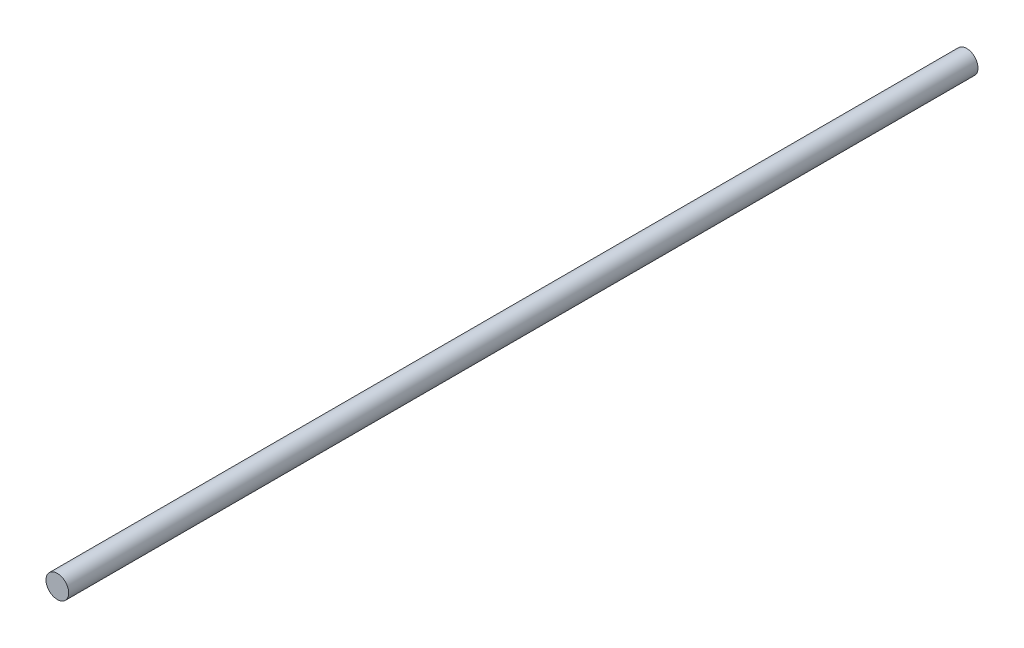
ISO-10303-21;
HEADER;
FILE_DESCRIPTION(('STEP AP214'),'2;1');
FILE_NAME('part.step','',(''),(''),'','','');
FILE_SCHEMA(('AUTOMOTIVE_DESIGN { 1 0 10303 214 1 1 1 1 }'));
ENDSEC;
DATA;
#1=APPLICATION_CONTEXT('core data for automotive mechanical design processes');
#2=APPLICATION_PROTOCOL_DEFINITION('international standard','automotive_design',2000,#1);
#3=PRODUCT_CONTEXT('',#1,'mechanical');
#4=PRODUCT('Part','Part','',(#3));
#5=PRODUCT_RELATED_PRODUCT_CATEGORY('part','',(#4));
#6=PRODUCT_DEFINITION_FORMATION('','',#4);
#7=PRODUCT_DEFINITION_CONTEXT('part definition',#1,'design');
#8=PRODUCT_DEFINITION('design','',#6,#7);
#9=PRODUCT_DEFINITION_SHAPE('','',#8);
#10=(LENGTH_UNIT() NAMED_UNIT(*) SI_UNIT(.MILLI.,.METRE.));
#11=(NAMED_UNIT(*) PLANE_ANGLE_UNIT() SI_UNIT($,.RADIAN.));
#12=(NAMED_UNIT(*) SI_UNIT($,.STERADIAN.) SOLID_ANGLE_UNIT());
#13=UNCERTAINTY_MEASURE_WITH_UNIT(LENGTH_MEASURE(1.E-05),#10,'distance_accuracy_value','');
#14=(GEOMETRIC_REPRESENTATION_CONTEXT(3) GLOBAL_UNCERTAINTY_ASSIGNED_CONTEXT((#13)) GLOBAL_UNIT_ASSIGNED_CONTEXT((#10,
#11,#12)) REPRESENTATION_CONTEXT('',''));
#15=CARTESIAN_POINT('',(0.,0.,0.));
#16=DIRECTION('',(0.,0.,1.));
#17=DIRECTION('',(1.,0.,0.));
#18=AXIS2_PLACEMENT_3D('',#15,#16,#17);
#19=CARTESIAN_POINT('',(0.,0.,70.));
#20=DIRECTION('',(0.,0.,-1.));
#21=DIRECTION('',(-1.,0.,0.));
#22=AXIS2_PLACEMENT_3D('',#19,#20,#21);
#23=CYLINDRICAL_SURFACE('',#22,0.875000000000001);
#24=CARTESIAN_POINT('',(0.,0.,70.));
#25=DIRECTION('',(0.,0.,1.));
#26=DIRECTION('',(1.,0.,0.));
#27=AXIS2_PLACEMENT_3D('',#24,#25,#26);
#28=CIRCLE('',#27,0.875000000000001);
#29=CARTESIAN_POINT('',(0.875000000000001,0.,70.));
#30=VERTEX_POINT('',#29);
#31=EDGE_CURVE('E10',#30,#30,#28,.T.);
#32=ORIENTED_EDGE('',*,*,#31,.F.);
#33=EDGE_LOOP('',(#32));
#34=FACE_BOUND('',#33,.T.);
#35=CARTESIAN_POINT('',(0.,0.,0.));
#36=DIRECTION('',(0.,0.,1.));
#37=DIRECTION('',(1.,0.,0.));
#38=AXIS2_PLACEMENT_3D('',#35,#36,#37);
#39=CIRCLE('',#38,0.875000000000001);
#40=CARTESIAN_POINT('',(0.875000000000001,0.,0.));
#41=VERTEX_POINT('',#40);
#42=EDGE_CURVE('E31',#41,#41,#39,.T.);
#43=ORIENTED_EDGE('',*,*,#42,.T.);
#44=EDGE_LOOP('',(#43));
#45=FACE_BOUND('',#44,.T.);
#46=ADVANCED_FACE('F28',(#34,#45),#23,.T.);
#47=CARTESIAN_POINT('',(0.,0.,70.));
#48=DIRECTION('',(0.,0.,1.));
#49=DIRECTION('',(1.,0.,0.));
#50=AXIS2_PLACEMENT_3D('',#47,#48,#49);
#51=PLANE('',#50);
#52=ORIENTED_EDGE('',*,*,#31,.T.);
#53=EDGE_LOOP('',(#52));
#54=FACE_BOUND('',#53,.T.);
#55=ADVANCED_FACE('F43',(#54),#51,.T.);
#56=CARTESIAN_POINT('',(0.,0.,0.));
#57=DIRECTION('',(0.,0.,1.));
#58=DIRECTION('',(1.,0.,0.));
#59=AXIS2_PLACEMENT_3D('',#56,#57,#58);
#60=PLANE('',#59);
#61=ORIENTED_EDGE('',*,*,#42,.F.);
#62=EDGE_LOOP('',(#61));
#63=FACE_BOUND('',#62,.T.);
#64=ADVANCED_FACE('F41',(#63),#60,.F.);
#65=CLOSED_SHELL('',(#46,#55,#64));
#66=MANIFOLD_SOLID_BREP('B2',#65);
#67=ADVANCED_BREP_SHAPE_REPRESENTATION('',(#18,#66),#14);
#68=SHAPE_DEFINITION_REPRESENTATION(#9,#67);
ENDSEC;
END-ISO-10303-21;
